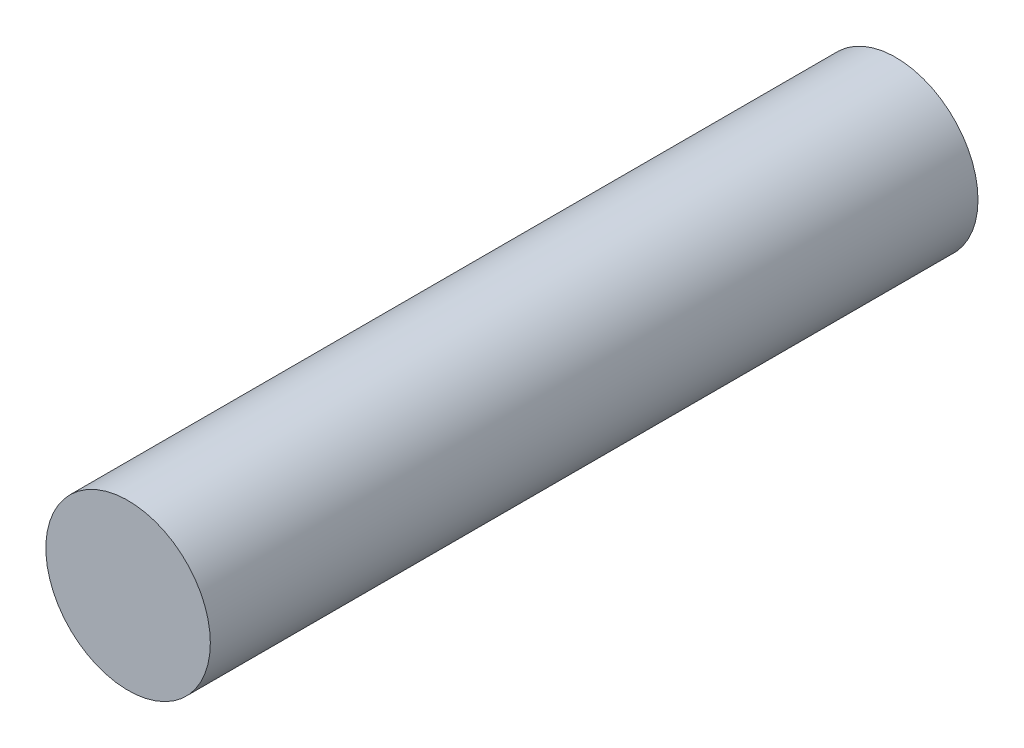
ISO-10303-21;
HEADER;
FILE_DESCRIPTION(('STEP AP214'),'2;1');
FILE_NAME('part.step','',(''),(''),'','','');
FILE_SCHEMA(('AUTOMOTIVE_DESIGN { 1 0 10303 214 1 1 1 1 }'));
ENDSEC;
DATA;
#1=APPLICATION_CONTEXT('core data for automotive mechanical design processes');
#2=APPLICATION_PROTOCOL_DEFINITION('international standard','automotive_design',2000,#1);
#3=PRODUCT_CONTEXT('',#1,'mechanical');
#4=PRODUCT('Part','Part','',(#3));
#5=PRODUCT_RELATED_PRODUCT_CATEGORY('part','',(#4));
#6=PRODUCT_DEFINITION_FORMATION('','',#4);
#7=PRODUCT_DEFINITION_CONTEXT('part definition',#1,'design');
#8=PRODUCT_DEFINITION('design','',#6,#7);
#9=PRODUCT_DEFINITION_SHAPE('','',#8);
#10=(LENGTH_UNIT() NAMED_UNIT(*) SI_UNIT(.MILLI.,.METRE.));
#11=(NAMED_UNIT(*) PLANE_ANGLE_UNIT() SI_UNIT($,.RADIAN.));
#12=(NAMED_UNIT(*) SI_UNIT($,.STERADIAN.) SOLID_ANGLE_UNIT());
#13=UNCERTAINTY_MEASURE_WITH_UNIT(LENGTH_MEASURE(1.E-05),#10,'distance_accuracy_value','');
#14=(GEOMETRIC_REPRESENTATION_CONTEXT(3) GLOBAL_UNCERTAINTY_ASSIGNED_CONTEXT((#13)) GLOBAL_UNIT_ASSIGNED_CONTEXT((#10,
#11,#12)) REPRESENTATION_CONTEXT('',''));
#15=CARTESIAN_POINT('',(0.,0.,0.));
#16=DIRECTION('',(0.,0.,1.));
#17=DIRECTION('',(1.,0.,0.));
#18=AXIS2_PLACEMENT_3D('',#15,#16,#17);
#19=CARTESIAN_POINT('',(0.,0.,28.));
#20=DIRECTION('',(0.,0.,-1.));
#21=DIRECTION('',(-1.,0.,0.));
#22=AXIS2_PLACEMENT_3D('',#19,#20,#21);
#23=CYLINDRICAL_SURFACE('',#22,6.);
#24=CARTESIAN_POINT('',(0.,0.,28.));
#25=DIRECTION('',(0.,0.,1.));
#26=DIRECTION('',(1.,0.,0.));
#27=AXIS2_PLACEMENT_3D('',#24,#25,#26);
#28=CIRCLE('',#27,6.);
#29=CARTESIAN_POINT('',(6.,0.,28.));
#30=VERTEX_POINT('',#29);
#31=EDGE_CURVE('E10',#30,#30,#28,.T.);
#32=ORIENTED_EDGE('',*,*,#31,.F.);
#33=EDGE_LOOP('',(#32));
#34=FACE_BOUND('',#33,.T.);
#35=CARTESIAN_POINT('',(0.,0.,-28.));
#36=DIRECTION('',(0.,0.,1.));
#37=DIRECTION('',(1.,0.,0.));
#38=AXIS2_PLACEMENT_3D('',#35,#36,#37);
#39=CIRCLE('',#38,6.);
#40=CARTESIAN_POINT('',(6.,0.,-28.));
#41=VERTEX_POINT('',#40);
#42=EDGE_CURVE('E33',#41,#41,#39,.T.);
#43=ORIENTED_EDGE('',*,*,#42,.T.);
#44=EDGE_LOOP('',(#43));
#45=FACE_BOUND('',#44,.T.);
#46=ADVANCED_FACE('F30',(#34,#45),#23,.T.);
#47=CARTESIAN_POINT('',(0.,0.,28.));
#48=DIRECTION('',(0.,0.,1.));
#49=DIRECTION('',(1.,0.,0.));
#50=AXIS2_PLACEMENT_3D('',#47,#48,#49);
#51=PLANE('',#50);
#52=ORIENTED_EDGE('',*,*,#31,.T.);
#53=EDGE_LOOP('',(#52));
#54=FACE_BOUND('',#53,.T.);
#55=ADVANCED_FACE('F45',(#54),#51,.T.);
#56=CARTESIAN_POINT('',(0.,0.,-28.));
#57=DIRECTION('',(0.,0.,1.));
#58=DIRECTION('',(1.,0.,0.));
#59=AXIS2_PLACEMENT_3D('',#56,#57,#58);
#60=PLANE('',#59);
#61=ORIENTED_EDGE('',*,*,#42,.F.);
#62=EDGE_LOOP('',(#61));
#63=FACE_BOUND('',#62,.T.);
#64=ADVANCED_FACE('F43',(#63),#60,.F.);
#65=CLOSED_SHELL('',(#46,#55,#64));
#66=MANIFOLD_SOLID_BREP('B2',#65);
#67=ADVANCED_BREP_SHAPE_REPRESENTATION('',(#18,#66),#14);
#68=SHAPE_DEFINITION_REPRESENTATION(#9,#67);
ENDSEC;
END-ISO-10303-21;
